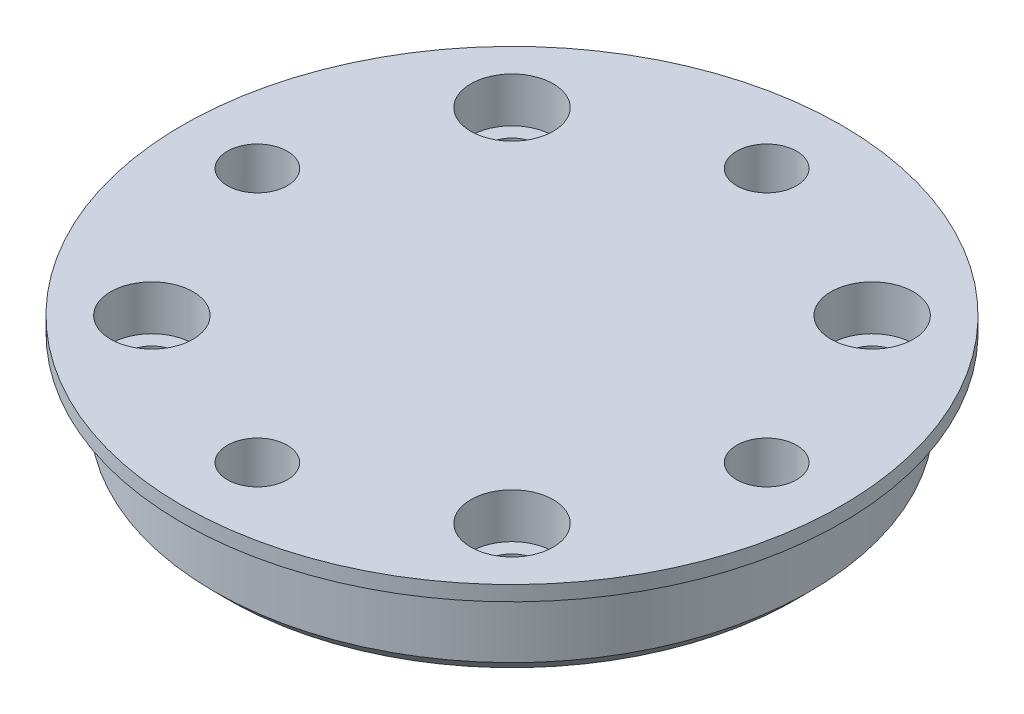
ISO-10303-21;
HEADER;
FILE_DESCRIPTION(('STEP AP214'),'2;1');
FILE_NAME('part.step','',(''),(''),'','','');
FILE_SCHEMA(('AUTOMOTIVE_DESIGN { 1 0 10303 214 1 1 1 1 }'));
ENDSEC;
DATA;
#1=APPLICATION_CONTEXT('core data for automotive mechanical design processes');
#2=APPLICATION_PROTOCOL_DEFINITION('international standard','automotive_design',2000,#1);
#3=PRODUCT_CONTEXT('',#1,'mechanical');
#4=PRODUCT('Part','Part','',(#3));
#5=PRODUCT_RELATED_PRODUCT_CATEGORY('part','',(#4));
#6=PRODUCT_DEFINITION_FORMATION('','',#4);
#7=PRODUCT_DEFINITION_CONTEXT('part definition',#1,'design');
#8=PRODUCT_DEFINITION('design','',#6,#7);
#9=PRODUCT_DEFINITION_SHAPE('','',#8);
#10=(LENGTH_UNIT() NAMED_UNIT(*) SI_UNIT(.MILLI.,.METRE.));
#11=(NAMED_UNIT(*) PLANE_ANGLE_UNIT() SI_UNIT($,.RADIAN.));
#12=(NAMED_UNIT(*) SI_UNIT($,.STERADIAN.) SOLID_ANGLE_UNIT());
#13=UNCERTAINTY_MEASURE_WITH_UNIT(LENGTH_MEASURE(1.E-05),#10,'distance_accuracy_value','');
#14=(GEOMETRIC_REPRESENTATION_CONTEXT(3) GLOBAL_UNCERTAINTY_ASSIGNED_CONTEXT((#13)) GLOBAL_UNIT_ASSIGNED_CONTEXT((#10,
#11,#12)) REPRESENTATION_CONTEXT('',''));
#15=CARTESIAN_POINT('',(0.,0.,0.));
#16=DIRECTION('',(0.,0.,1.));
#17=DIRECTION('',(1.,0.,0.));
#18=AXIS2_PLACEMENT_3D('',#15,#16,#17);
#19=CARTESIAN_POINT('',(-12.0208152801713,0.,-12.0208152801713));
#20=DIRECTION('',(0.,1.,0.));
#21=DIRECTION('',(0.,0.,1.));
#22=AXIS2_PLACEMENT_3D('',#19,#20,#21);
#23=CYLINDRICAL_SURFACE('',#22,1.75);
#24=CARTESIAN_POINT('',(-12.0208152801713,0.,-12.0208152801713));
#25=DIRECTION('',(0.,1.,0.));
#26=DIRECTION('',(0.,0.,1.));
#27=AXIS2_PLACEMENT_3D('',#24,#25,#26);
#28=CIRCLE('',#27,1.75);
#29=CARTESIAN_POINT('',(-12.0208152801713,0.,-10.2708152801713));
#30=VERTEX_POINT('',#29);
#31=EDGE_CURVE('E182',#30,#30,#28,.T.);
#32=ORIENTED_EDGE('',*,*,#31,.F.);
#33=EDGE_LOOP('',(#32));
#34=FACE_BOUND('',#33,.T.);
#35=CARTESIAN_POINT('',(-12.0208152801713,4.,-12.0208152801713));
#36=DIRECTION('',(0.,1.,0.));
#37=DIRECTION('',(0.,0.,1.));
#38=AXIS2_PLACEMENT_3D('',#35,#36,#37);
#39=CIRCLE('',#38,1.75);
#40=CARTESIAN_POINT('',(-12.0208152801713,4.,-10.2708152801713));
#41=VERTEX_POINT('',#40);
#42=EDGE_CURVE('E209',#41,#41,#39,.T.);
#43=ORIENTED_EDGE('',*,*,#42,.T.);
#44=EDGE_LOOP('',(#43));
#45=FACE_BOUND('',#44,.T.);
#46=ADVANCED_FACE('F43',(#34,#45),#23,.F.);
#47=CARTESIAN_POINT('',(12.0208152801713,0.,-12.020815280172));
#48=DIRECTION('',(0.,1.,0.));
#49=DIRECTION('',(0.,0.,1.));
#50=AXIS2_PLACEMENT_3D('',#47,#48,#49);
#51=CYLINDRICAL_SURFACE('',#50,1.7500000000007);
#52=CARTESIAN_POINT('',(12.0208152801713,0.,-12.020815280172));
#53=DIRECTION('',(0.,1.,0.));
#54=DIRECTION('',(0.,0.,1.));
#55=AXIS2_PLACEMENT_3D('',#52,#53,#54);
#56=CIRCLE('',#55,1.7500000000007);
#57=CARTESIAN_POINT('',(12.0208152801713,0.,-10.2708152801713));
#58=VERTEX_POINT('',#57);
#59=EDGE_CURVE('E188',#58,#58,#56,.T.);
#60=ORIENTED_EDGE('',*,*,#59,.F.);
#61=EDGE_LOOP('',(#60));
#62=FACE_BOUND('',#61,.T.);
#63=CARTESIAN_POINT('',(12.0208152801713,4.,-12.0208152801727));
#64=DIRECTION('',(0.,1.,0.));
#65=DIRECTION('',(0.,0.,1.));
#66=AXIS2_PLACEMENT_3D('',#63,#64,#65);
#67=CIRCLE('',#66,1.75000000000135);
#68=CARTESIAN_POINT('',(12.0208152801713,4.,-10.2708152801713));
#69=VERTEX_POINT('',#68);
#70=EDGE_CURVE('E214',#69,#69,#67,.T.);
#71=ORIENTED_EDGE('',*,*,#70,.T.);
#72=EDGE_LOOP('',(#71));
#73=FACE_BOUND('',#72,.T.);
#74=ADVANCED_FACE('F136',(#62,#73),#51,.F.);
#75=CARTESIAN_POINT('',(12.020815280172,0.,12.0208152801706));
#76=DIRECTION('',(0.,1.,0.));
#77=DIRECTION('',(0.,0.,1.));
#78=AXIS2_PLACEMENT_3D('',#75,#76,#77);
#79=CYLINDRICAL_SURFACE('',#78,1.75000000000095);
#80=CARTESIAN_POINT('',(12.020815280172,0.,12.0208152801706));
#81=DIRECTION('',(0.,1.,0.));
#82=DIRECTION('',(0.,0.,1.));
#83=AXIS2_PLACEMENT_3D('',#80,#81,#82);
#84=CIRCLE('',#83,1.75000000000095);
#85=CARTESIAN_POINT('',(12.020815280172,0.,13.7708152801716));
#86=VERTEX_POINT('',#85);
#87=EDGE_CURVE('E198',#86,#86,#84,.T.);
#88=ORIENTED_EDGE('',*,*,#87,.F.);
#89=EDGE_LOOP('',(#88));
#90=FACE_BOUND('',#89,.T.);
#91=CARTESIAN_POINT('',(12.0208152801727,4.,12.0208152801699));
#92=DIRECTION('',(0.,1.,0.));
#93=DIRECTION('',(0.,0.,1.));
#94=AXIS2_PLACEMENT_3D('',#91,#92,#93);
#95=CIRCLE('',#94,1.7500000000018);
#96=CARTESIAN_POINT('',(12.0208152801727,4.,13.7708152801717));
#97=VERTEX_POINT('',#96);
#98=EDGE_CURVE('E225',#97,#97,#95,.T.);
#99=ORIENTED_EDGE('',*,*,#98,.T.);
#100=EDGE_LOOP('',(#99));
#101=FACE_BOUND('',#100,.T.);
#102=ADVANCED_FACE('F139',(#90,#101),#79,.F.);
#103=CARTESIAN_POINT('',(-12.0208152801706,0.,12.0208152801713));
#104=DIRECTION('',(0.,1.,0.));
#105=DIRECTION('',(0.,0.,1.));
#106=AXIS2_PLACEMENT_3D('',#103,#104,#105);
#107=CYLINDRICAL_SURFACE('',#106,1.75000000000036);
#108=CARTESIAN_POINT('',(-12.0208152801706,0.,12.0208152801713));
#109=DIRECTION('',(0.,1.,0.));
#110=DIRECTION('',(0.,0.,1.));
#111=AXIS2_PLACEMENT_3D('',#108,#109,#110);
#112=CIRCLE('',#111,1.75000000000036);
#113=CARTESIAN_POINT('',(-12.0208152801706,0.,13.7708152801717));
#114=VERTEX_POINT('',#113);
#115=EDGE_CURVE('E195',#114,#114,#112,.T.);
#116=ORIENTED_EDGE('',*,*,#115,.F.);
#117=EDGE_LOOP('',(#116));
#118=FACE_BOUND('',#117,.T.);
#119=CARTESIAN_POINT('',(-12.0208152801699,4.,12.0208152801713));
#120=DIRECTION('',(0.,1.,0.));
#121=DIRECTION('',(0.,0.,1.));
#122=AXIS2_PLACEMENT_3D('',#119,#120,#121);
#123=CIRCLE('',#122,1.75000000000056);
#124=CARTESIAN_POINT('',(-12.0208152801699,4.,13.7708152801719));
#125=VERTEX_POINT('',#124);
#126=EDGE_CURVE('E215',#125,#125,#123,.T.);
#127=ORIENTED_EDGE('',*,*,#126,.T.);
#128=EDGE_LOOP('',(#127));
#129=FACE_BOUND('',#128,.T.);
#130=ADVANCED_FACE('F143',(#118,#129),#107,.F.);
#131=CARTESIAN_POINT('',(0.,6.,0.));
#132=DIRECTION('',(0.,-1.,0.));
#133=DIRECTION('',(0.,0.,-1.));
#134=AXIS2_PLACEMENT_3D('',#131,#132,#133);
#135=CYLINDRICAL_SURFACE('',#134,19.9);
#136=CARTESIAN_POINT('',(0.,1.00000000000002,0.));
#137=DIRECTION('',(0.,1.,0.));
#138=DIRECTION('',(0.,0.,1.));
#139=AXIS2_PLACEMENT_3D('',#136,#137,#138);
#140=CIRCLE('',#139,19.9);
#141=CARTESIAN_POINT('',(0.,1.00000000000002,19.9));
#142=VERTEX_POINT('',#141);
#143=EDGE_CURVE('E168',#142,#142,#140,.T.);
#144=ORIENTED_EDGE('',*,*,#143,.T.);
#145=EDGE_LOOP('',(#144));
#146=FACE_BOUND('',#145,.T.);
#147=CARTESIAN_POINT('',(0.,6.,0.));
#148=DIRECTION('',(0.,1.,0.));
#149=DIRECTION('',(0.,0.,1.));
#150=AXIS2_PLACEMENT_3D('',#147,#148,#149);
#151=CIRCLE('',#150,19.9);
#152=CARTESIAN_POINT('',(0.,6.,19.9));
#153=VERTEX_POINT('',#152);
#154=EDGE_CURVE('E170',#153,#153,#151,.T.);
#155=ORIENTED_EDGE('',*,*,#154,.F.);
#156=EDGE_LOOP('',(#155));
#157=FACE_BOUND('',#156,.T.);
#158=ADVANCED_FACE('F147',(#146,#157),#135,.T.);
#159=CARTESIAN_POINT('',(0.,0.,0.));
#160=DIRECTION('',(0.,1.,0.));
#161=DIRECTION('',(0.,0.,1.));
#162=AXIS2_PLACEMENT_3D('',#159,#160,#161);
#163=PLANE('',#162);
#164=CARTESIAN_POINT('',(-16.9999999999995,0.,4.82128110537593E-13));
#165=DIRECTION('',(0.,1.,0.));
#166=DIRECTION('',(0.,0.,1.));
#167=AXIS2_PLACEMENT_3D('',#164,#165,#166);
#168=CIRCLE('',#167,2.);
#169=CARTESIAN_POINT('',(-18.8885294117647,0.,0.658374255950513));
#170=VERTEX_POINT('',#169);
#171=CARTESIAN_POINT('',(-18.8885294117648,0.,-0.658374255949444));
#172=VERTEX_POINT('',#171);
#173=EDGE_CURVE('E185',#170,#172,#168,.T.);
#174=ORIENTED_EDGE('',*,*,#173,.T.);
#175=CARTESIAN_POINT('',(0.,0.,0.));
#176=DIRECTION('',(0.,1.,0.));
#177=DIRECTION('',(0.,0.,1.));
#178=AXIS2_PLACEMENT_3D('',#175,#176,#177);
#179=CIRCLE('',#178,18.9);
#180=CARTESIAN_POINT('',(-0.658374255951514,0.,-18.8885294117647));
#181=VERTEX_POINT('',#180);
#182=EDGE_CURVE('E99',#172,#181,#179,.F.);
#183=ORIENTED_EDGE('',*,*,#182,.T.);
#184=CARTESIAN_POINT('',(0.,0.,-17.));
#185=DIRECTION('',(0.,1.,0.));
#186=DIRECTION('',(0.,0.,1.));
#187=AXIS2_PLACEMENT_3D('',#184,#185,#186);
#188=CIRCLE('',#187,2.);
#189=CARTESIAN_POINT('',(0.658374255951514,0.,-18.8885294117647));
#190=VERTEX_POINT('',#189);
#191=EDGE_CURVE('E93',#181,#190,#188,.T.);
#192=ORIENTED_EDGE('',*,*,#191,.T.);
#193=CARTESIAN_POINT('',(0.,0.,0.));
#194=DIRECTION('',(0.,1.,0.));
#195=DIRECTION('',(0.,0.,1.));
#196=AXIS2_PLACEMENT_3D('',#193,#194,#195);
#197=CIRCLE('',#196,18.9);
#198=CARTESIAN_POINT('',(18.8885294117646,0.,-0.658374255953577));
#199=VERTEX_POINT('',#198);
#200=EDGE_CURVE('E104',#190,#199,#197,.F.);
#201=ORIENTED_EDGE('',*,*,#200,.T.);
#202=CARTESIAN_POINT('',(17.0000000000005,0.,-4.80046210979042E-13));
#203=DIRECTION('',(0.,1.,0.));
#204=DIRECTION('',(0.,0.,1.));
#205=AXIS2_PLACEMENT_3D('',#202,#203,#204);
#206=CIRCLE('',#205,2.);
#207=CARTESIAN_POINT('',(18.8885294117647,0.,0.658374255952512));
#208=VERTEX_POINT('',#207);
#209=EDGE_CURVE('E164',#199,#208,#206,.T.);
#210=ORIENTED_EDGE('',*,*,#209,.T.);
#211=CARTESIAN_POINT('',(0.,0.,0.));
#212=DIRECTION('',(0.,1.,0.));
#213=DIRECTION('',(0.,0.,1.));
#214=AXIS2_PLACEMENT_3D('',#211,#212,#213);
#215=CIRCLE('',#214,18.9);
#216=CARTESIAN_POINT('',(0.658374255952581,0.,18.8885294117647));
#217=VERTEX_POINT('',#216);
#218=EDGE_CURVE('E112',#208,#217,#215,.F.);
#219=ORIENTED_EDGE('',*,*,#218,.T.);
#220=CARTESIAN_POINT('',(9.60092421958085E-13,0.,17.));
#221=DIRECTION('',(0.,1.,0.));
#222=DIRECTION('',(0.,0.,1.));
#223=AXIS2_PLACEMENT_3D('',#220,#221,#222);
#224=CIRCLE('',#223,2.);
#225=CARTESIAN_POINT('',(-0.658374255950447,0.,18.8885294117647));
#226=VERTEX_POINT('',#225);
#227=EDGE_CURVE('E191',#217,#226,#224,.T.);
#228=ORIENTED_EDGE('',*,*,#227,.T.);
#229=CARTESIAN_POINT('',(0.,0.,0.));
#230=DIRECTION('',(0.,1.,0.));
#231=DIRECTION('',(0.,0.,1.));
#232=AXIS2_PLACEMENT_3D('',#229,#230,#231);
#233=CIRCLE('',#232,18.9);
#234=EDGE_CURVE('E65',#226,#170,#233,.F.);
#235=ORIENTED_EDGE('',*,*,#234,.T.);
#236=EDGE_LOOP('',(#174,#183,#192,#201,#210,#219,#228,#235));
#237=FACE_BOUND('',#236,.T.);
#238=ORIENTED_EDGE('',*,*,#115,.T.);
#239=EDGE_LOOP('',(#238));
#240=FACE_BOUND('',#239,.T.);
#241=ORIENTED_EDGE('',*,*,#87,.T.);
#242=EDGE_LOOP('',(#241));
#243=FACE_BOUND('',#242,.T.);
#244=ORIENTED_EDGE('',*,*,#59,.T.);
#245=EDGE_LOOP('',(#244));
#246=FACE_BOUND('',#245,.T.);
#247=ORIENTED_EDGE('',*,*,#31,.T.);
#248=EDGE_LOOP('',(#247));
#249=FACE_BOUND('',#248,.T.);
#250=ADVANCED_FACE('F101',(#237,#240,#243,#246,#249),#163,.F.);
#251=CARTESIAN_POINT('',(0.,7.,0.));
#252=DIRECTION('',(0.,-1.,0.));
#253=DIRECTION('',(0.,0.,-1.));
#254=AXIS2_PLACEMENT_3D('',#251,#252,#253);
#255=CYLINDRICAL_SURFACE('',#254,22.);
#256=CARTESIAN_POINT('',(0.,7.,0.));
#257=DIRECTION('',(0.,1.,0.));
#258=DIRECTION('',(0.,0.,1.));
#259=AXIS2_PLACEMENT_3D('',#256,#257,#258);
#260=CIRCLE('',#259,22.);
#261=CARTESIAN_POINT('',(0.,7.,22.));
#262=VERTEX_POINT('',#261);
#263=EDGE_CURVE('E175',#262,#262,#260,.T.);
#264=ORIENTED_EDGE('',*,*,#263,.F.);
#265=EDGE_LOOP('',(#264));
#266=FACE_BOUND('',#265,.T.);
#267=CARTESIAN_POINT('',(0.,6.,0.));
#268=DIRECTION('',(0.,1.,0.));
#269=DIRECTION('',(0.,0.,1.));
#270=AXIS2_PLACEMENT_3D('',#267,#268,#269);
#271=CIRCLE('',#270,22.);
#272=CARTESIAN_POINT('',(0.,6.,22.));
#273=VERTEX_POINT('',#272);
#274=EDGE_CURVE('E106',#273,#273,#271,.T.);
#275=ORIENTED_EDGE('',*,*,#274,.T.);
#276=EDGE_LOOP('',(#275));
#277=FACE_BOUND('',#276,.T.);
#278=ADVANCED_FACE('F248',(#266,#277),#255,.T.);
#279=CARTESIAN_POINT('',(0.,7.,0.));
#280=DIRECTION('',(0.,1.,0.));
#281=DIRECTION('',(0.,0.,1.));
#282=AXIS2_PLACEMENT_3D('',#279,#280,#281);
#283=PLANE('',#282);
#284=CARTESIAN_POINT('',(-12.0208152801699,7.,12.0208152801713));
#285=DIRECTION('',(0.,1.,0.));
#286=DIRECTION('',(0.,0.,1.));
#287=AXIS2_PLACEMENT_3D('',#284,#285,#286);
#288=CIRCLE('',#287,2.75000000000013);
#289=CARTESIAN_POINT('',(-12.0208152801699,7.,14.7708152801715));
#290=VERTEX_POINT('',#289);
#291=EDGE_CURVE('E219',#290,#290,#288,.T.);
#292=ORIENTED_EDGE('',*,*,#291,.F.);
#293=EDGE_LOOP('',(#292));
#294=FACE_BOUND('',#293,.T.);
#295=CARTESIAN_POINT('',(12.0208152801727,7.,12.0208152801699));
#296=DIRECTION('',(0.,1.,0.));
#297=DIRECTION('',(0.,0.,1.));
#298=AXIS2_PLACEMENT_3D('',#295,#296,#297);
#299=CIRCLE('',#298,2.75000000000145);
#300=CARTESIAN_POINT('',(12.0208152801727,7.,14.7708152801714));
#301=VERTEX_POINT('',#300);
#302=EDGE_CURVE('E229',#301,#301,#299,.T.);
#303=ORIENTED_EDGE('',*,*,#302,.F.);
#304=EDGE_LOOP('',(#303));
#305=FACE_BOUND('',#304,.T.);
#306=CARTESIAN_POINT('',(12.0208152801713,7.,-12.0208152801727));
#307=DIRECTION('',(0.,1.,0.));
#308=DIRECTION('',(0.,0.,1.));
#309=AXIS2_PLACEMENT_3D('',#306,#307,#308);
#310=CIRCLE('',#309,2.7500000000014);
#311=CARTESIAN_POINT('',(12.0208152801713,7.,-9.27081528017129));
#312=VERTEX_POINT('',#311);
#313=EDGE_CURVE('E236',#312,#312,#310,.T.);
#314=ORIENTED_EDGE('',*,*,#313,.F.);
#315=EDGE_LOOP('',(#314));
#316=FACE_BOUND('',#315,.T.);
#317=CARTESIAN_POINT('',(-12.0208152801713,7.,-12.0208152801713));
#318=DIRECTION('',(0.,1.,0.));
#319=DIRECTION('',(0.,0.,1.));
#320=AXIS2_PLACEMENT_3D('',#317,#318,#319);
#321=CIRCLE('',#320,2.75);
#322=CARTESIAN_POINT('',(-12.0208152801713,7.,-9.27081528017128));
#323=VERTEX_POINT('',#322);
#324=EDGE_CURVE('E206',#323,#323,#321,.T.);
#325=ORIENTED_EDGE('',*,*,#324,.F.);
#326=EDGE_LOOP('',(#325));
#327=FACE_BOUND('',#326,.T.);
#328=CARTESIAN_POINT('',(0.,7.,-17.));
#329=DIRECTION('',(0.,1.,0.));
#330=DIRECTION('',(0.,0.,1.));
#331=AXIS2_PLACEMENT_3D('',#328,#329,#330);
#332=CIRCLE('',#331,2.);
#333=CARTESIAN_POINT('',(0.,7.,-15.));
#334=VERTEX_POINT('',#333);
#335=EDGE_CURVE('E107',#334,#334,#332,.T.);
#336=ORIENTED_EDGE('',*,*,#335,.F.);
#337=EDGE_LOOP('',(#336));
#338=FACE_BOUND('',#337,.T.);
#339=CARTESIAN_POINT('',(17.0000000000005,7.,-4.80046210979042E-13));
#340=DIRECTION('',(0.,1.,0.));
#341=DIRECTION('',(0.,0.,1.));
#342=AXIS2_PLACEMENT_3D('',#339,#340,#341);
#343=CIRCLE('',#342,2.);
#344=CARTESIAN_POINT('',(17.0000000000005,7.,1.99999999999952));
#345=VERTEX_POINT('',#344);
#346=EDGE_CURVE('E165',#345,#345,#343,.T.);
#347=ORIENTED_EDGE('',*,*,#346,.F.);
#348=EDGE_LOOP('',(#347));
#349=FACE_BOUND('',#348,.T.);
#350=CARTESIAN_POINT('',(9.60092421958085E-13,7.,17.));
#351=DIRECTION('',(0.,1.,0.));
#352=DIRECTION('',(0.,0.,1.));
#353=AXIS2_PLACEMENT_3D('',#350,#351,#352);
#354=CIRCLE('',#353,2.);
#355=CARTESIAN_POINT('',(9.60092421958085E-13,7.,19.));
#356=VERTEX_POINT('',#355);
#357=EDGE_CURVE('E166',#356,#356,#354,.T.);
#358=ORIENTED_EDGE('',*,*,#357,.F.);
#359=EDGE_LOOP('',(#358));
#360=FACE_BOUND('',#359,.T.);
#361=CARTESIAN_POINT('',(-16.9999999999995,7.,4.82128110537593E-13));
#362=DIRECTION('',(0.,1.,0.));
#363=DIRECTION('',(0.,0.,1.));
#364=AXIS2_PLACEMENT_3D('',#361,#362,#363);
#365=CIRCLE('',#364,2.);
#366=CARTESIAN_POINT('',(-16.9999999999995,7.,2.00000000000048));
#367=VERTEX_POINT('',#366);
#368=EDGE_CURVE('E187',#367,#367,#365,.T.);
#369=ORIENTED_EDGE('',*,*,#368,.F.);
#370=EDGE_LOOP('',(#369));
#371=FACE_BOUND('',#370,.T.);
#372=ORIENTED_EDGE('',*,*,#263,.T.);
#373=EDGE_LOOP('',(#372));
#374=FACE_BOUND('',#373,.T.);
#375=ADVANCED_FACE('F244',(#294,#305,#316,#327,#338,#349,#360,#371,#374),#283,.T.);
#376=CARTESIAN_POINT('',(0.,6.,0.));
#377=DIRECTION('',(0.,1.,0.));
#378=DIRECTION('',(0.,0.,1.));
#379=AXIS2_PLACEMENT_3D('',#376,#377,#378);
#380=PLANE('',#379);
#381=ORIENTED_EDGE('',*,*,#154,.T.);
#382=EDGE_LOOP('',(#381));
#383=FACE_BOUND('',#382,.T.);
#384=ORIENTED_EDGE('',*,*,#274,.F.);
#385=EDGE_LOOP('',(#384));
#386=FACE_BOUND('',#385,.T.);
#387=ADVANCED_FACE('F247',(#383,#386),#380,.F.);
#388=CARTESIAN_POINT('',(-16.9999999999995,0.,4.82128110537593E-13));
#389=DIRECTION('',(0.,1.,0.));
#390=DIRECTION('',(0.,0.,1.));
#391=AXIS2_PLACEMENT_3D('',#388,#389,#390);
#392=CYLINDRICAL_SURFACE('',#391,2.);
#393=ORIENTED_EDGE('',*,*,#173,.F.);
#394=CARTESIAN_POINT('',(-18.8885294117647,0.,0.658374255950514));
#395=CARTESIAN_POINT('',(-18.9021799928745,0.0122781631587925,0.619220256822092));
#396=CARTESIAN_POINT('',(-18.9147058555554,0.0235330191212143,0.57936584488147));
#397=CARTESIAN_POINT('',(-18.9373557946374,0.0438697464778791,0.498419405487634));
#398=CARTESIAN_POINT('',(-18.9474787529583,0.0529506063205026,0.457326811886415));
#399=CARTESIAN_POINT('',(-18.9739581601437,0.07669188832695,0.332675159301684));
#400=CARTESIAN_POINT('',(-18.9864864628135,0.0879060755391798,0.247568649287992));
#401=CARTESIAN_POINT('',(-19.0004476702279,0.100401613237209,0.0754737058137994));
#402=CARTESIAN_POINT('',(-19.0018439617629,0.10165018681261,-0.0115199948677466));
#403=CARTESIAN_POINT('',(-18.9933514729969,0.0940507483685624,-0.184473524066526));
#404=CARTESIAN_POINT('',(-18.9834710054997,0.0852101736912116,-0.270434067011461));
#405=CARTESIAN_POINT('',(-18.9588910067301,0.0631843679357688,-0.40692265436589));
#406=CARTESIAN_POINT('',(-18.9474276974713,0.0529071559532629,-0.458554927068279));
#407=CARTESIAN_POINT('',(-18.9207307290193,0.028945663211915,-0.559949063914487));
#408=CARTESIAN_POINT('',(-18.9055021355346,0.0152659599238509,-0.609713338439412));
#409=CARTESIAN_POINT('',(-18.8885294117648,0.,-0.658374255949446));
#410=B_SPLINE_CURVE_WITH_KNOTS('',3,(#394,#395,#396,#397,#398,#399,#400,#401,#402,#403,#404,
#405,#406,#407,#408,#409),.UNSPECIFIED.,.F.,.F.,(4,2,2,2,2,2,2,4),(0.,0.129674199053784,
0.259408618228395,0.518307902696885,0.778058357646169,1.0376174579058,1.1990029228755,
1.36017243463805),.UNSPECIFIED.);
#411=EDGE_CURVE('E11',#170,#172,#410,.T.);
#412=ORIENTED_EDGE('',*,*,#411,.T.);
#413=EDGE_LOOP('',(#393,#412));
#414=FACE_BOUND('',#413,.T.);
#415=ORIENTED_EDGE('',*,*,#368,.T.);
#416=EDGE_LOOP('',(#415));
#417=FACE_BOUND('',#416,.T.);
#418=ADVANCED_FACE('F152',(#414,#417),#392,.F.);
#419=CARTESIAN_POINT('',(9.60092421958085E-13,0.,17.));
#420=DIRECTION('',(0.,1.,0.));
#421=DIRECTION('',(0.,0.,1.));
#422=AXIS2_PLACEMENT_3D('',#419,#420,#421);
#423=CYLINDRICAL_SURFACE('',#422,2.);
#424=ORIENTED_EDGE('',*,*,#227,.F.);
#425=CARTESIAN_POINT('',(0.658374255952581,0.,18.8885294117647));
#426=CARTESIAN_POINT('',(0.619220256824172,0.0122781631588182,18.9021799928745));
#427=CARTESIAN_POINT('',(0.579365844883563,0.0235330191212684,18.9147058555553));
#428=CARTESIAN_POINT('',(0.498419405489749,0.0438697464779927,18.9373557946374));
#429=CARTESIAN_POINT('',(0.45732681188854,0.0529506063206475,18.9474787529584));
#430=CARTESIAN_POINT('',(0.332675159303834,0.0766918883271887,18.9739581601439));
#431=CARTESIAN_POINT('',(0.247568649290152,0.087906075539482,18.9864864628137));
#432=CARTESIAN_POINT('',(0.0754737058159598,0.100401613237635,19.0004476702283));
#433=CARTESIAN_POINT('',(-0.0115199948655953,0.101650186813097,19.0018439617634));
#434=CARTESIAN_POINT('',(-0.18447352406441,0.0940507483691693,18.9933514729975));
#435=CARTESIAN_POINT('',(-0.270434067009371,0.0852101736918783,18.9834710055004));
#436=CARTESIAN_POINT('',(-0.406922654364375,0.0631843679364422,18.9588910067308));
#437=CARTESIAN_POINT('',(-0.458554927067294,0.0529071559538492,18.9474276974719));
#438=CARTESIAN_POINT('',(-0.559949063914526,0.0289456632122576,18.9207307290196));
#439=CARTESIAN_POINT('',(-0.609713338439947,0.0152659599240369,18.9055021355348));
#440=CARTESIAN_POINT('',(-0.658374255950449,0.,18.8885294117647));
#441=B_SPLINE_CURVE_WITH_KNOTS('',3,(#425,#426,#427,#428,#429,#430,#431,#432,#433,#434,#435,
#436,#437,#438,#439,#440),.UNSPECIFIED.,.F.,.F.,(4,2,2,2,2,2,2,4),(0.,0.129674199053801,
0.259408618228428,0.518307902696945,0.778058357646263,1.03761745790593,1.19900292287726,
1.36017243464143),.UNSPECIFIED.);
#442=EDGE_CURVE('E58',#217,#226,#441,.T.);
#443=ORIENTED_EDGE('',*,*,#442,.T.);
#444=EDGE_LOOP('',(#424,#443));
#445=FACE_BOUND('',#444,.T.);
#446=ORIENTED_EDGE('',*,*,#357,.T.);
#447=EDGE_LOOP('',(#446));
#448=FACE_BOUND('',#447,.T.);
#449=ADVANCED_FACE('F149',(#445,#448),#423,.F.);
#450=CARTESIAN_POINT('',(17.0000000000005,0.,-4.80046210979042E-13));
#451=DIRECTION('',(0.,1.,0.));
#452=DIRECTION('',(0.,0.,1.));
#453=AXIS2_PLACEMENT_3D('',#450,#451,#452);
#454=CYLINDRICAL_SURFACE('',#453,2.);
#455=ORIENTED_EDGE('',*,*,#209,.F.);
#456=CARTESIAN_POINT('',(18.8885294117646,0.,-0.658374255953578));
#457=CARTESIAN_POINT('',(18.9021799928745,0.0122781631588481,-0.619220256825183));
#458=CARTESIAN_POINT('',(18.9147058555554,0.023533019121328,-0.579365844884586));
#459=CARTESIAN_POINT('',(18.9373557946375,0.0438697464781119,-0.498419405490792));
#460=CARTESIAN_POINT('',(18.9474787529586,0.0529506063207964,-0.457326811889591));
#461=CARTESIAN_POINT('',(18.9739581601442,0.0766918883274272,-0.332675159304906));
#462=CARTESIAN_POINT('',(18.986486462814,0.0879060755397808,-0.247568649291232));
#463=CARTESIAN_POINT('',(19.0004476702287,0.10040161323806,-0.0754737058170395));
#464=CARTESIAN_POINT('',(19.0018439617639,0.101650186813588,0.0115199948645251));
#465=CARTESIAN_POINT('',(18.9933514729982,0.0940507483697843,0.184473524063375));
#466=CARTESIAN_POINT('',(18.983471005501,0.0852101736925506,0.270434067008363));
#467=CARTESIAN_POINT('',(18.9588910067315,0.0631843679371187,0.406922654363938));
#468=CARTESIAN_POINT('',(18.9474276974725,0.0529071559544383,0.458554927067383));
#469=CARTESIAN_POINT('',(18.9207307290199,0.028945663212603,0.559949063915634));
#470=CARTESIAN_POINT('',(18.9055021355349,0.0152659599242261,0.609713338441546));
#471=CARTESIAN_POINT('',(18.8885294117647,0.,0.658374255952515));
#472=B_SPLINE_CURVE_WITH_KNOTS('',3,(#456,#457,#458,#459,#460,#461,#462,#463,#464,#465,#466,
#467,#468,#469,#470,#471),.UNSPECIFIED.,.F.,.F.,(4,2,2,2,2,2,2,4),(0.,0.129674199053817,
0.259408618228461,0.518307902697009,0.778058357646359,1.03761745790606,1.19900292287902,
1.36017243464481),.UNSPECIFIED.);
#473=EDGE_CURVE('E98',#199,#208,#472,.T.);
#474=ORIENTED_EDGE('',*,*,#473,.T.);
#475=EDGE_LOOP('',(#455,#474));
#476=FACE_BOUND('',#475,.T.);
#477=ORIENTED_EDGE('',*,*,#346,.T.);
#478=EDGE_LOOP('',(#477));
#479=FACE_BOUND('',#478,.T.);
#480=ADVANCED_FACE('F133',(#476,#479),#454,.F.);
#481=CARTESIAN_POINT('',(0.,0.,-17.));
#482=DIRECTION('',(0.,1.,0.));
#483=DIRECTION('',(0.,0.,1.));
#484=AXIS2_PLACEMENT_3D('',#481,#482,#483);
#485=CYLINDRICAL_SURFACE('',#484,2.);
#486=ORIENTED_EDGE('',*,*,#191,.F.);
#487=CARTESIAN_POINT('',(-0.658374255951514,0.,-18.8885294117647));
#488=CARTESIAN_POINT('',(-0.619220256823106,0.0122781631588213,-18.9021799928745));
#489=CARTESIAN_POINT('',(-0.579365844882496,0.0235330191212717,-18.9147058555554));
#490=CARTESIAN_POINT('',(-0.49841940548868,0.0438697464779947,-18.9373557946374));
#491=CARTESIAN_POINT('',(-0.457326811887469,0.0529506063206477,-18.9474787529585));
#492=CARTESIAN_POINT('',(-0.33267515930276,0.0766918883271858,-18.973958160144));
#493=CARTESIAN_POINT('',(-0.247568649289078,0.0879060755394796,-18.9864864628137));
#494=CARTESIAN_POINT('',(-0.0754737058148856,0.100401613237635,-19.0004476702283));
#495=CARTESIAN_POINT('',(0.0115199948666697,0.101650186813099,-19.0018439617634));
#496=CARTESIAN_POINT('',(0.184473524065484,0.0940507483691713,-18.9933514729975));
#497=CARTESIAN_POINT('',(0.270434067010445,0.0852101736918785,-18.9834710055003));
#498=CARTESIAN_POINT('',(0.406922654365447,0.0631843679364429,-18.9588910067308));
#499=CARTESIAN_POINT('',(0.458554927068365,0.0529071559538509,-18.9474276974719));
#500=CARTESIAN_POINT('',(0.559949063915596,0.0289456632122604,-18.9207307290196));
#501=CARTESIAN_POINT('',(0.609713338441015,0.0152659599240397,-18.9055021355347));
#502=CARTESIAN_POINT('',(0.658374255951516,0.,-18.8885294117647));
#503=B_SPLINE_CURVE_WITH_KNOTS('',3,(#487,#488,#489,#490,#491,#492,#493,#494,#495,#496,#497,
#498,#499,#500,#501,#502),.UNSPECIFIED.,.F.,.F.,(4,2,2,2,2,2,2,4),(0.,0.1296741990538,
0.259408618228428,0.518307902696946,0.778058357646263,1.03761745790593,1.19900292287726,
1.36017243464143),.UNSPECIFIED.);
#504=EDGE_CURVE('E89',#181,#190,#503,.T.);
#505=ORIENTED_EDGE('',*,*,#504,.T.);
#506=EDGE_LOOP('',(#486,#505));
#507=FACE_BOUND('',#506,.T.);
#508=ORIENTED_EDGE('',*,*,#335,.T.);
#509=EDGE_LOOP('',(#508));
#510=FACE_BOUND('',#509,.T.);
#511=ADVANCED_FACE('F91',(#507,#510),#485,.F.);
#512=CARTESIAN_POINT('',(-12.0208152801699,4.,12.0208152801713));
#513=DIRECTION('',(0.,1.,0.));
#514=DIRECTION('',(0.,0.,1.));
#515=AXIS2_PLACEMENT_3D('',#512,#513,#514);
#516=CYLINDRICAL_SURFACE('',#515,2.75000000000013);
#517=CARTESIAN_POINT('',(-12.0208152801699,4.,12.0208152801713));
#518=DIRECTION('',(0.,1.,0.));
#519=DIRECTION('',(0.,0.,1.));
#520=AXIS2_PLACEMENT_3D('',#517,#518,#519);
#521=CIRCLE('',#520,2.75000000000013);
#522=CARTESIAN_POINT('',(-12.0208152801699,4.,14.7708152801715));
#523=VERTEX_POINT('',#522);
#524=EDGE_CURVE('E220',#523,#523,#521,.T.);
#525=ORIENTED_EDGE('',*,*,#524,.F.);
#526=EDGE_LOOP('',(#525));
#527=FACE_BOUND('',#526,.T.);
#528=ORIENTED_EDGE('',*,*,#291,.T.);
#529=EDGE_LOOP('',(#528));
#530=FACE_BOUND('',#529,.T.);
#531=ADVANCED_FACE('F132',(#527,#530),#516,.F.);
#532=CARTESIAN_POINT('',(-12.0208152801699,4.,12.0208152801713));
#533=DIRECTION('',(0.,1.,0.));
#534=DIRECTION('',(0.,0.,1.));
#535=AXIS2_PLACEMENT_3D('',#532,#533,#534);
#536=PLANE('',#535);
#537=ORIENTED_EDGE('',*,*,#126,.F.);
#538=EDGE_LOOP('',(#537));
#539=FACE_BOUND('',#538,.T.);
#540=ORIENTED_EDGE('',*,*,#524,.T.);
#541=EDGE_LOOP('',(#540));
#542=FACE_BOUND('',#541,.T.);
#543=ADVANCED_FACE('F344',(#539,#542),#536,.T.);
#544=CARTESIAN_POINT('',(12.0208152801727,4.,12.0208152801699));
#545=DIRECTION('',(0.,1.,0.));
#546=DIRECTION('',(0.,0.,1.));
#547=AXIS2_PLACEMENT_3D('',#544,#545,#546);
#548=CYLINDRICAL_SURFACE('',#547,2.75000000000145);
#549=CARTESIAN_POINT('',(12.0208152801727,4.,12.0208152801699));
#550=DIRECTION('',(0.,1.,0.));
#551=DIRECTION('',(0.,0.,1.));
#552=AXIS2_PLACEMENT_3D('',#549,#550,#551);
#553=CIRCLE('',#552,2.75000000000145);
#554=CARTESIAN_POINT('',(12.0208152801727,4.,14.7708152801714));
#555=VERTEX_POINT('',#554);
#556=EDGE_CURVE('E218',#555,#555,#553,.T.);
#557=ORIENTED_EDGE('',*,*,#556,.F.);
#558=EDGE_LOOP('',(#557));
#559=FACE_BOUND('',#558,.T.);
#560=ORIENTED_EDGE('',*,*,#302,.T.);
#561=EDGE_LOOP('',(#560));
#562=FACE_BOUND('',#561,.T.);
#563=ADVANCED_FACE('F336',(#559,#562),#548,.F.);
#564=CARTESIAN_POINT('',(12.0208152801727,4.,12.0208152801699));
#565=DIRECTION('',(0.,1.,0.));
#566=DIRECTION('',(0.,0.,1.));
#567=AXIS2_PLACEMENT_3D('',#564,#565,#566);
#568=PLANE('',#567);
#569=ORIENTED_EDGE('',*,*,#98,.F.);
#570=EDGE_LOOP('',(#569));
#571=FACE_BOUND('',#570,.T.);
#572=ORIENTED_EDGE('',*,*,#556,.T.);
#573=EDGE_LOOP('',(#572));
#574=FACE_BOUND('',#573,.T.);
#575=ADVANCED_FACE('F328',(#571,#574),#568,.T.);
#576=CARTESIAN_POINT('',(12.0208152801713,4.,-12.0208152801727));
#577=DIRECTION('',(0.,1.,0.));
#578=DIRECTION('',(0.,0.,1.));
#579=AXIS2_PLACEMENT_3D('',#576,#577,#578);
#580=CYLINDRICAL_SURFACE('',#579,2.7500000000014);
#581=CARTESIAN_POINT('',(12.0208152801713,4.,-12.0208152801727));
#582=DIRECTION('',(0.,1.,0.));
#583=DIRECTION('',(0.,0.,1.));
#584=AXIS2_PLACEMENT_3D('',#581,#582,#583);
#585=CIRCLE('',#584,2.7500000000014);
#586=CARTESIAN_POINT('',(12.0208152801713,4.,-9.27081528017129));
#587=VERTEX_POINT('',#586);
#588=EDGE_CURVE('E228',#587,#587,#585,.T.);
#589=ORIENTED_EDGE('',*,*,#588,.F.);
#590=EDGE_LOOP('',(#589));
#591=FACE_BOUND('',#590,.T.);
#592=ORIENTED_EDGE('',*,*,#313,.T.);
#593=EDGE_LOOP('',(#592));
#594=FACE_BOUND('',#593,.T.);
#595=ADVANCED_FACE('F242',(#591,#594),#580,.F.);
#596=CARTESIAN_POINT('',(12.0208152801713,4.,-12.0208152801727));
#597=DIRECTION('',(0.,1.,0.));
#598=DIRECTION('',(0.,0.,1.));
#599=AXIS2_PLACEMENT_3D('',#596,#597,#598);
#600=PLANE('',#599);
#601=ORIENTED_EDGE('',*,*,#70,.F.);
#602=EDGE_LOOP('',(#601));
#603=FACE_BOUND('',#602,.T.);
#604=ORIENTED_EDGE('',*,*,#588,.T.);
#605=EDGE_LOOP('',(#604));
#606=FACE_BOUND('',#605,.T.);
#607=ADVANCED_FACE('F314',(#603,#606),#600,.T.);
#608=CARTESIAN_POINT('',(-12.0208152801713,4.,-12.0208152801713));
#609=DIRECTION('',(0.,1.,0.));
#610=DIRECTION('',(0.,0.,1.));
#611=AXIS2_PLACEMENT_3D('',#608,#609,#610);
#612=CYLINDRICAL_SURFACE('',#611,2.75);
#613=CARTESIAN_POINT('',(-12.0208152801713,4.,-12.0208152801713));
#614=DIRECTION('',(0.,1.,0.));
#615=DIRECTION('',(0.,0.,1.));
#616=AXIS2_PLACEMENT_3D('',#613,#614,#615);
#617=CIRCLE('',#616,2.75);
#618=CARTESIAN_POINT('',(-12.0208152801713,4.,-9.27081528017128));
#619=VERTEX_POINT('',#618);
#620=EDGE_CURVE('E199',#619,#619,#617,.T.);
#621=ORIENTED_EDGE('',*,*,#620,.F.);
#622=EDGE_LOOP('',(#621));
#623=FACE_BOUND('',#622,.T.);
#624=ORIENTED_EDGE('',*,*,#324,.T.);
#625=EDGE_LOOP('',(#624));
#626=FACE_BOUND('',#625,.T.);
#627=ADVANCED_FACE('F134',(#623,#626),#612,.F.);
#628=CARTESIAN_POINT('',(-12.0208152801713,4.,-12.0208152801713));
#629=DIRECTION('',(0.,1.,0.));
#630=DIRECTION('',(0.,0.,1.));
#631=AXIS2_PLACEMENT_3D('',#628,#629,#630);
#632=PLANE('',#631);
#633=ORIENTED_EDGE('',*,*,#42,.F.);
#634=EDGE_LOOP('',(#633));
#635=FACE_BOUND('',#634,.T.);
#636=ORIENTED_EDGE('',*,*,#620,.T.);
#637=EDGE_LOOP('',(#636));
#638=FACE_BOUND('',#637,.T.);
#639=ADVANCED_FACE('F298',(#635,#638),#632,.T.);
#640=CARTESIAN_POINT('',(0.,1.00000000000002,0.));
#641=DIRECTION('',(0.,1.,0.));
#642=DIRECTION('',(0.,0.,1.));
#643=AXIS2_PLACEMENT_3D('',#640,#641,#642);
#644=CONICAL_SURFACE('',#643,19.9,0.785398163397444);
#645=ORIENTED_EDGE('',*,*,#504,.F.);
#646=ORIENTED_EDGE('',*,*,#182,.F.);
#647=ORIENTED_EDGE('',*,*,#411,.F.);
#648=ORIENTED_EDGE('',*,*,#234,.F.);
#649=ORIENTED_EDGE('',*,*,#442,.F.);
#650=ORIENTED_EDGE('',*,*,#218,.F.);
#651=ORIENTED_EDGE('',*,*,#473,.F.);
#652=ORIENTED_EDGE('',*,*,#200,.F.);
#653=EDGE_LOOP('',(#645,#646,#647,#648,#649,#650,#651,#652));
#654=FACE_BOUND('',#653,.T.);
#655=ORIENTED_EDGE('',*,*,#143,.F.);
#656=EDGE_LOOP('',(#655));
#657=FACE_BOUND('',#656,.T.);
#658=ADVANCED_FACE('F46',(#654,#657),#644,.T.);
#659=CLOSED_SHELL('',(#46,#74,#102,#130,#158,#250,#278,#375,#387,#418,#449,#480,#511,#531,#543,
#563,#575,#595,#607,#627,#639,#658));
#660=MANIFOLD_SOLID_BREP('B2',#659);
#661=ADVANCED_BREP_SHAPE_REPRESENTATION('',(#18,#660),#14);
#662=SHAPE_DEFINITION_REPRESENTATION(#9,#661);
ENDSEC;
END-ISO-10303-21;
